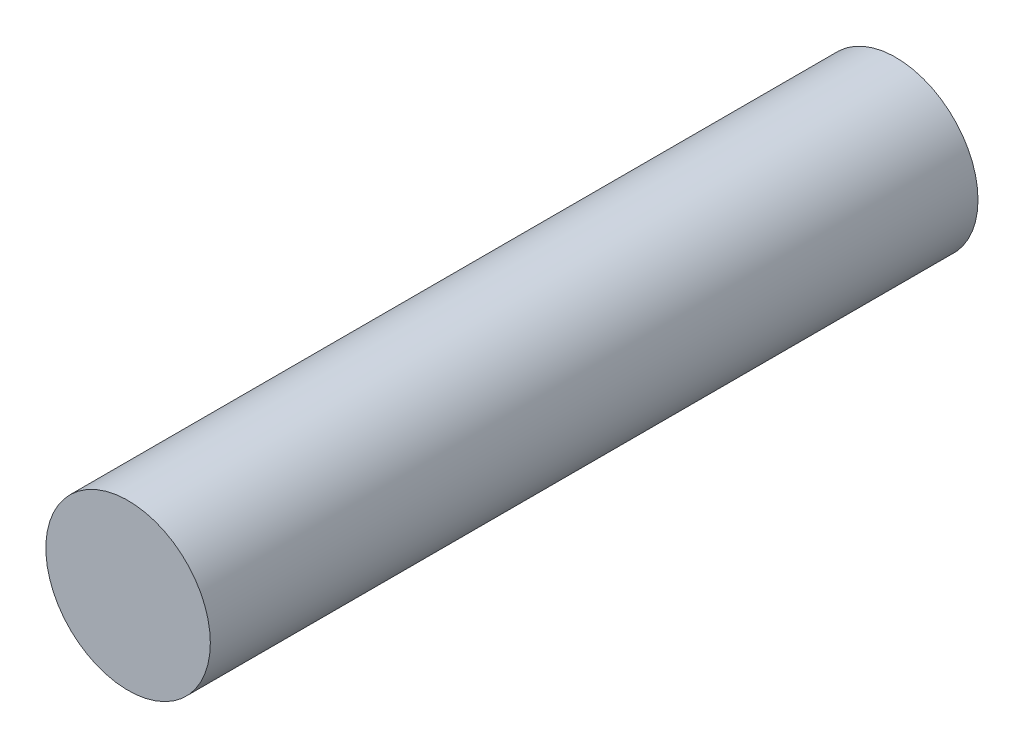
ISO-10303-21;
HEADER;
FILE_DESCRIPTION(('STEP AP214'),'2;1');
FILE_NAME('part.step','',(''),(''),'','','');
FILE_SCHEMA(('AUTOMOTIVE_DESIGN { 1 0 10303 214 1 1 1 1 }'));
ENDSEC;
DATA;
#1=APPLICATION_CONTEXT('core data for automotive mechanical design processes');
#2=APPLICATION_PROTOCOL_DEFINITION('international standard','automotive_design',2000,#1);
#3=PRODUCT_CONTEXT('',#1,'mechanical');
#4=PRODUCT('Part','Part','',(#3));
#5=PRODUCT_RELATED_PRODUCT_CATEGORY('part','',(#4));
#6=PRODUCT_DEFINITION_FORMATION('','',#4);
#7=PRODUCT_DEFINITION_CONTEXT('part definition',#1,'design');
#8=PRODUCT_DEFINITION('design','',#6,#7);
#9=PRODUCT_DEFINITION_SHAPE('','',#8);
#10=(LENGTH_UNIT() NAMED_UNIT(*) SI_UNIT(.MILLI.,.METRE.));
#11=(NAMED_UNIT(*) PLANE_ANGLE_UNIT() SI_UNIT($,.RADIAN.));
#12=(NAMED_UNIT(*) SI_UNIT($,.STERADIAN.) SOLID_ANGLE_UNIT());
#13=UNCERTAINTY_MEASURE_WITH_UNIT(LENGTH_MEASURE(1.E-05),#10,'distance_accuracy_value','');
#14=(GEOMETRIC_REPRESENTATION_CONTEXT(3) GLOBAL_UNCERTAINTY_ASSIGNED_CONTEXT((#13)) GLOBAL_UNIT_ASSIGNED_CONTEXT((#10,
#11,#12)) REPRESENTATION_CONTEXT('',''));
#15=CARTESIAN_POINT('',(0.,0.,0.));
#16=DIRECTION('',(0.,0.,1.));
#17=DIRECTION('',(1.,0.,0.));
#18=AXIS2_PLACEMENT_3D('',#15,#16,#17);
#19=CARTESIAN_POINT('',(0.,0.,700.));
#20=DIRECTION('',(0.,0.,-1.));
#21=DIRECTION('',(-1.,0.,0.));
#22=AXIS2_PLACEMENT_3D('',#19,#20,#21);
#23=CYLINDRICAL_SURFACE('',#22,147.);
#24=CARTESIAN_POINT('',(0.,0.,700.));
#25=DIRECTION('',(0.,0.,1.));
#26=DIRECTION('',(1.,0.,0.));
#27=AXIS2_PLACEMENT_3D('',#24,#25,#26);
#28=CIRCLE('',#27,147.);
#29=CARTESIAN_POINT('',(147.,0.,700.));
#30=VERTEX_POINT('',#29);
#31=EDGE_CURVE('E10',#30,#30,#28,.T.);
#32=ORIENTED_EDGE('',*,*,#31,.F.);
#33=EDGE_LOOP('',(#32));
#34=FACE_BOUND('',#33,.T.);
#35=CARTESIAN_POINT('',(0.,0.,-672.));
#36=DIRECTION('',(0.,0.,1.));
#37=DIRECTION('',(1.,0.,0.));
#38=AXIS2_PLACEMENT_3D('',#35,#36,#37);
#39=CIRCLE('',#38,147.);
#40=CARTESIAN_POINT('',(147.,0.,-672.));
#41=VERTEX_POINT('',#40);
#42=EDGE_CURVE('E39',#41,#41,#39,.T.);
#43=ORIENTED_EDGE('',*,*,#42,.T.);
#44=EDGE_LOOP('',(#43));
#45=FACE_BOUND('',#44,.T.);
#46=ADVANCED_FACE('F36',(#34,#45),#23,.T.);
#47=CARTESIAN_POINT('',(0.,0.,700.));
#48=DIRECTION('',(0.,0.,1.));
#49=DIRECTION('',(1.,0.,0.));
#50=AXIS2_PLACEMENT_3D('',#47,#48,#49);
#51=PLANE('',#50);
#52=ORIENTED_EDGE('',*,*,#31,.T.);
#53=EDGE_LOOP('',(#52));
#54=FACE_BOUND('',#53,.T.);
#55=ADVANCED_FACE('F53',(#54),#51,.T.);
#56=CARTESIAN_POINT('',(0.,0.,-672.));
#57=DIRECTION('',(0.,0.,1.));
#58=DIRECTION('',(1.,0.,0.));
#59=AXIS2_PLACEMENT_3D('',#56,#57,#58);
#60=PLANE('',#59);
#61=ORIENTED_EDGE('',*,*,#42,.F.);
#62=EDGE_LOOP('',(#61));
#63=FACE_BOUND('',#62,.T.);
#64=ADVANCED_FACE('F51',(#63),#60,.F.);
#65=CLOSED_SHELL('',(#46,#55,#64));
#66=MANIFOLD_SOLID_BREP('B2',#65);
#67=ADVANCED_BREP_SHAPE_REPRESENTATION('',(#18,#66),#14);
#68=SHAPE_DEFINITION_REPRESENTATION(#9,#67);
ENDSEC;
END-ISO-10303-21;
